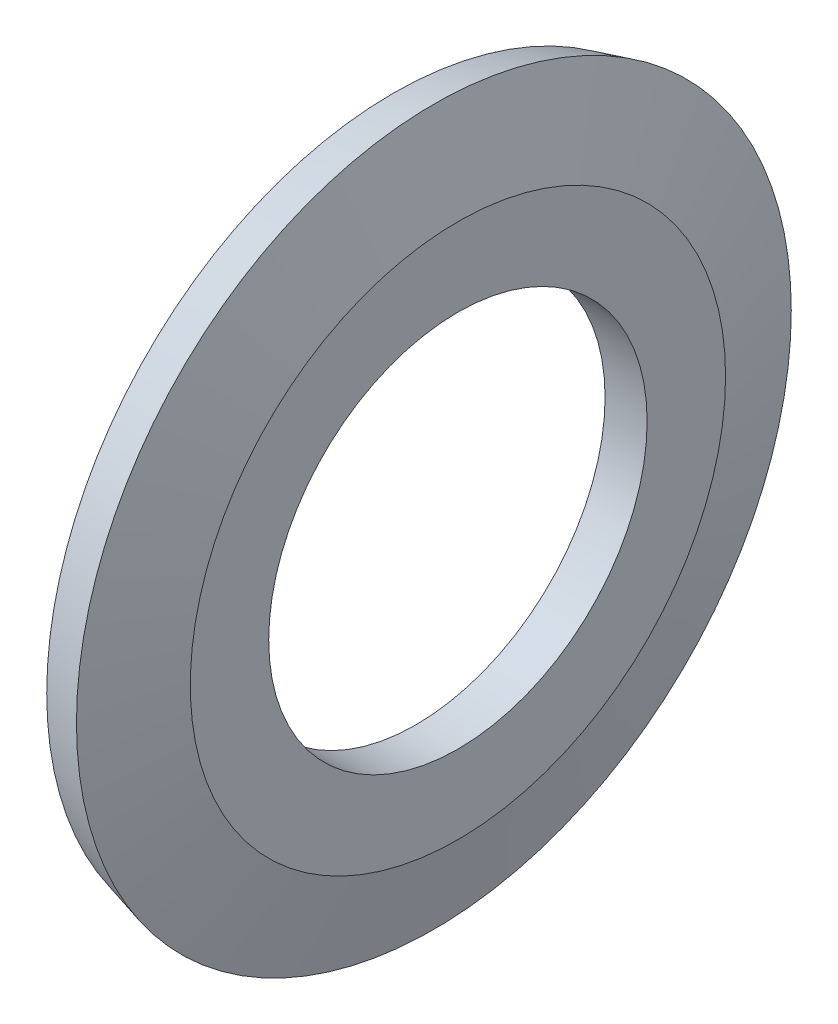
ISO-10303-21;
HEADER;
FILE_DESCRIPTION(('STEP AP214'),'2;1');
FILE_NAME('part.step','',(''),(''),'','','');
FILE_SCHEMA(('AUTOMOTIVE_DESIGN { 1 0 10303 214 1 1 1 1 }'));
ENDSEC;
DATA;
#1=APPLICATION_CONTEXT('core data for automotive mechanical design processes');
#2=APPLICATION_PROTOCOL_DEFINITION('international standard','automotive_design',2000,#1);
#3=PRODUCT_CONTEXT('',#1,'mechanical');
#4=PRODUCT('Part','Part','',(#3));
#5=PRODUCT_RELATED_PRODUCT_CATEGORY('part','',(#4));
#6=PRODUCT_DEFINITION_FORMATION('','',#4);
#7=PRODUCT_DEFINITION_CONTEXT('part definition',#1,'design');
#8=PRODUCT_DEFINITION('design','',#6,#7);
#9=PRODUCT_DEFINITION_SHAPE('','',#8);
#10=(LENGTH_UNIT() NAMED_UNIT(*) SI_UNIT(.MILLI.,.METRE.));
#11=(NAMED_UNIT(*) PLANE_ANGLE_UNIT() SI_UNIT($,.RADIAN.));
#12=(NAMED_UNIT(*) SI_UNIT($,.STERADIAN.) SOLID_ANGLE_UNIT());
#13=UNCERTAINTY_MEASURE_WITH_UNIT(LENGTH_MEASURE(1.E-05),#10,'distance_accuracy_value','');
#14=(GEOMETRIC_REPRESENTATION_CONTEXT(3) GLOBAL_UNCERTAINTY_ASSIGNED_CONTEXT((#13)) GLOBAL_UNIT_ASSIGNED_CONTEXT((#10,
#11,#12)) REPRESENTATION_CONTEXT('',''));
#15=CARTESIAN_POINT('',(0.,0.,0.));
#16=DIRECTION('',(0.,0.,1.));
#17=DIRECTION('',(1.,0.,0.));
#18=AXIS2_PLACEMENT_3D('',#15,#16,#17);
#19=CARTESIAN_POINT('',(0.999999999999999,4.5,0.));
#20=DIRECTION('',(1.,0.,0.));
#21=DIRECTION('',(0.,0.,-1.));
#22=AXIS2_PLACEMENT_3D('',#19,#20,#21);
#23=PLANE('',#22);
#24=CARTESIAN_POINT('',(0.999999999999999,0.,0.));
#25=DIRECTION('',(1.,0.,0.));
#26=DIRECTION('',(0.,0.,-1.));
#27=AXIS2_PLACEMENT_3D('',#24,#25,#26);
#28=CIRCLE('',#27,6.365);
#29=CARTESIAN_POINT('',(0.999999999999999,0.,-6.365));
#30=VERTEX_POINT('',#29);
#31=EDGE_CURVE('E10',#30,#30,#28,.T.);
#32=ORIENTED_EDGE('',*,*,#31,.T.);
#33=EDGE_LOOP('',(#32));
#34=FACE_BOUND('',#33,.T.);
#35=CARTESIAN_POINT('',(0.999999999999999,0.,0.));
#36=DIRECTION('',(1.,0.,0.));
#37=DIRECTION('',(0.,0.,-1.));
#38=AXIS2_PLACEMENT_3D('',#35,#36,#37);
#39=CIRCLE('',#38,4.5);
#40=CARTESIAN_POINT('',(0.999999999999999,0.,-4.5));
#41=VERTEX_POINT('',#40);
#42=EDGE_CURVE('E53',#41,#41,#39,.T.);
#43=ORIENTED_EDGE('',*,*,#42,.F.);
#44=EDGE_LOOP('',(#43));
#45=FACE_BOUND('',#44,.T.);
#46=ADVANCED_FACE('F31',(#34,#45),#23,.T.);
#47=CARTESIAN_POINT('',(0.999999999999999,0.,0.));
#48=DIRECTION('',(-1.,0.,0.));
#49=DIRECTION('',(0.,0.,1.));
#50=AXIS2_PLACEMENT_3D('',#47,#48,#49);
#51=CONICAL_SURFACE('',#50,6.365,1.30899693899575);
#52=CARTESIAN_POINT('',(0.427928474159548,0.,0.));
#53=DIRECTION('',(1.,0.,0.));
#54=DIRECTION('',(0.,0.,-1.));
#55=AXIS2_PLACEMENT_3D('',#52,#53,#54);
#56=CIRCLE('',#55,8.5);
#57=CARTESIAN_POINT('',(0.427928474159548,0.,-8.5));
#58=VERTEX_POINT('',#57);
#59=EDGE_CURVE('E37',#58,#58,#56,.T.);
#60=ORIENTED_EDGE('',*,*,#59,.T.);
#61=EDGE_LOOP('',(#60));
#62=FACE_BOUND('',#61,.T.);
#63=ORIENTED_EDGE('',*,*,#31,.F.);
#64=EDGE_LOOP('',(#63));
#65=FACE_BOUND('',#64,.T.);
#66=ADVANCED_FACE('F61',(#62,#65),#51,.T.);
#67=CARTESIAN_POINT('',(0.427928474159548,0.,0.));
#68=DIRECTION('',(1.,0.,0.));
#69=DIRECTION('',(0.,0.,-1.));
#70=AXIS2_PLACEMENT_3D('',#67,#68,#69);
#71=CONICAL_SURFACE('',#70,8.5,0.261799387799151);
#72=CARTESIAN_POINT('',(-0.53799735212952,0.,0.));
#73=DIRECTION('',(1.,0.,0.));
#74=DIRECTION('',(0.,0.,-1.));
#75=AXIS2_PLACEMENT_3D('',#72,#73,#74);
#76=CIRCLE('',#75,8.24118095489748);
#77=CARTESIAN_POINT('',(-0.53799735212952,0.,-8.24118095489748));
#78=VERTEX_POINT('',#77);
#79=EDGE_CURVE('E41',#78,#78,#76,.T.);
#80=ORIENTED_EDGE('',*,*,#79,.T.);
#81=EDGE_LOOP('',(#80));
#82=FACE_BOUND('',#81,.T.);
#83=ORIENTED_EDGE('',*,*,#59,.F.);
#84=EDGE_LOOP('',(#83));
#85=FACE_BOUND('',#84,.T.);
#86=ADVANCED_FACE('F65',(#82,#85),#71,.T.);
#87=CARTESIAN_POINT('',(-0.53799735212952,0.,0.));
#88=DIRECTION('',(-1.,0.,0.));
#89=DIRECTION('',(0.,0.,1.));
#90=AXIS2_PLACEMENT_3D('',#87,#88,#89);
#91=CONICAL_SURFACE('',#90,8.24118095489748,1.30899693899575);
#92=CARTESIAN_POINT('',(0.,0.,0.));
#93=DIRECTION('',(1.,0.,0.));
#94=DIRECTION('',(0.,0.,-1.));
#95=AXIS2_PLACEMENT_3D('',#92,#93,#94);
#96=CIRCLE('',#95,6.23334750241259);
#97=CARTESIAN_POINT('',(0.,0.,-6.23334750241259));
#98=VERTEX_POINT('',#97);
#99=EDGE_CURVE('E45',#98,#98,#96,.T.);
#100=ORIENTED_EDGE('',*,*,#99,.T.);
#101=EDGE_LOOP('',(#100));
#102=FACE_BOUND('',#101,.T.);
#103=ORIENTED_EDGE('',*,*,#79,.F.);
#104=EDGE_LOOP('',(#103));
#105=FACE_BOUND('',#104,.T.);
#106=ADVANCED_FACE('F69',(#102,#105),#91,.F.);
#107=CARTESIAN_POINT('',(0.,4.5,0.));
#108=DIRECTION('',(-1.,0.,0.));
#109=DIRECTION('',(0.,0.,1.));
#110=AXIS2_PLACEMENT_3D('',#107,#108,#109);
#111=PLANE('',#110);
#112=CARTESIAN_POINT('',(0.,0.,0.));
#113=DIRECTION('',(1.,0.,0.));
#114=DIRECTION('',(0.,0.,-1.));
#115=AXIS2_PLACEMENT_3D('',#112,#113,#114);
#116=CIRCLE('',#115,4.5);
#117=CARTESIAN_POINT('',(0.,0.,-4.5));
#118=VERTEX_POINT('',#117);
#119=EDGE_CURVE('E50',#118,#118,#116,.T.);
#120=ORIENTED_EDGE('',*,*,#119,.T.);
#121=EDGE_LOOP('',(#120));
#122=FACE_BOUND('',#121,.T.);
#123=ORIENTED_EDGE('',*,*,#99,.F.);
#124=EDGE_LOOP('',(#123));
#125=FACE_BOUND('',#124,.T.);
#126=ADVANCED_FACE('F76',(#122,#125),#111,.T.);
#127=CARTESIAN_POINT('',(0.999999999999999,0.,0.));
#128=DIRECTION('',(1.,0.,0.));
#129=DIRECTION('',(0.,0.,-1.));
#130=AXIS2_PLACEMENT_3D('',#127,#128,#129);
#131=CYLINDRICAL_SURFACE('',#130,4.5);
#132=ORIENTED_EDGE('',*,*,#42,.T.);
#133=EDGE_LOOP('',(#132));
#134=FACE_BOUND('',#133,.T.);
#135=ORIENTED_EDGE('',*,*,#119,.F.);
#136=EDGE_LOOP('',(#135));
#137=FACE_BOUND('',#136,.T.);
#138=ADVANCED_FACE('F57',(#134,#137),#131,.F.);
#139=CLOSED_SHELL('',(#46,#66,#86,#106,#126,#138));
#140=MANIFOLD_SOLID_BREP('B2',#139);
#141=ADVANCED_BREP_SHAPE_REPRESENTATION('',(#18,#140),#14);
#142=SHAPE_DEFINITION_REPRESENTATION(#9,#141);
ENDSEC;
END-ISO-10303-21;
